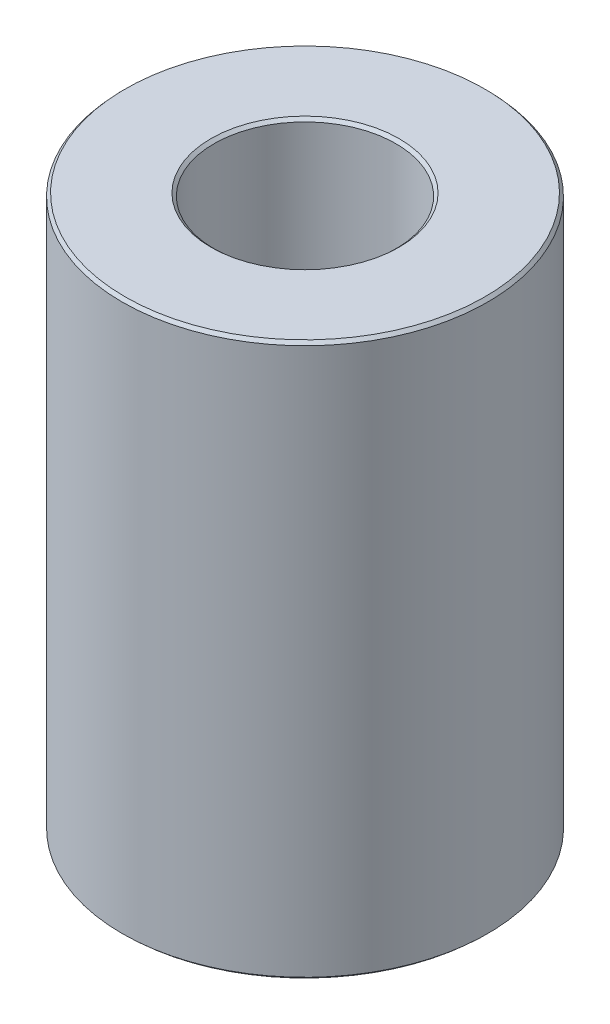
ISO-10303-21;
HEADER;
FILE_DESCRIPTION(('STEP AP214'),'2;1');
FILE_NAME('part.step','',(''),(''),'','','');
FILE_SCHEMA(('AUTOMOTIVE_DESIGN { 1 0 10303 214 1 1 1 1 }'));
ENDSEC;
DATA;
#1=APPLICATION_CONTEXT('core data for automotive mechanical design processes');
#2=APPLICATION_PROTOCOL_DEFINITION('international standard','automotive_design',2000,#1);
#3=PRODUCT_CONTEXT('',#1,'mechanical');
#4=PRODUCT('Part','Part','',(#3));
#5=PRODUCT_RELATED_PRODUCT_CATEGORY('part','',(#4));
#6=PRODUCT_DEFINITION_FORMATION('','',#4);
#7=PRODUCT_DEFINITION_CONTEXT('part definition',#1,'design');
#8=PRODUCT_DEFINITION('design','',#6,#7);
#9=PRODUCT_DEFINITION_SHAPE('','',#8);
#10=(LENGTH_UNIT() NAMED_UNIT(*) SI_UNIT(.MILLI.,.METRE.));
#11=(NAMED_UNIT(*) PLANE_ANGLE_UNIT() SI_UNIT($,.RADIAN.));
#12=(NAMED_UNIT(*) SI_UNIT($,.STERADIAN.) SOLID_ANGLE_UNIT());
#13=UNCERTAINTY_MEASURE_WITH_UNIT(LENGTH_MEASURE(1.E-05),#10,'distance_accuracy_value','');
#14=(GEOMETRIC_REPRESENTATION_CONTEXT(3) GLOBAL_UNCERTAINTY_ASSIGNED_CONTEXT((#13)) GLOBAL_UNIT_ASSIGNED_CONTEXT((#10,
#11,#12)) REPRESENTATION_CONTEXT('',''));
#15=CARTESIAN_POINT('',(0.,0.,0.));
#16=DIRECTION('',(0.,0.,1.));
#17=DIRECTION('',(1.,0.,0.));
#18=AXIS2_PLACEMENT_3D('',#15,#16,#17);
#19=CARTESIAN_POINT('',(0.,151.245814746017,0.));
#20=DIRECTION('',(0.,-1.,0.));
#21=DIRECTION('',(0.,0.,-1.));
#22=AXIS2_PLACEMENT_3D('',#19,#20,#21);
#23=CYLINDRICAL_SURFACE('',#22,50.);
#24=CARTESIAN_POINT('',(0.,0.775924782064841,0.));
#25=DIRECTION('',(0.,1.,0.));
#26=DIRECTION('',(0.,0.,1.));
#27=AXIS2_PLACEMENT_3D('',#24,#25,#26);
#28=CIRCLE('',#27,50.);
#29=CARTESIAN_POINT('',(0.,0.775924782064841,50.));
#30=VERTEX_POINT('',#29);
#31=EDGE_CURVE('E10',#30,#30,#28,.T.);
#32=ORIENTED_EDGE('',*,*,#31,.T.);
#33=EDGE_LOOP('',(#32));
#34=FACE_BOUND('',#33,.T.);
#35=CARTESIAN_POINT('',(0.,150.391701689345,0.));
#36=DIRECTION('',(0.,1.,0.));
#37=DIRECTION('',(0.,0.,1.));
#38=AXIS2_PLACEMENT_3D('',#35,#36,#37);
#39=CIRCLE('',#38,50.);
#40=CARTESIAN_POINT('',(0.,150.391701689345,50.));
#41=VERTEX_POINT('',#40);
#42=EDGE_CURVE('E50',#41,#41,#39,.F.);
#43=ORIENTED_EDGE('',*,*,#42,.T.);
#44=EDGE_LOOP('',(#43));
#45=FACE_BOUND('',#44,.T.);
#46=ADVANCED_FACE('F39',(#34,#45),#23,.T.);
#47=CARTESIAN_POINT('',(0.,151.245814746017,0.));
#48=DIRECTION('',(0.,1.,0.));
#49=DIRECTION('',(0.,0.,1.));
#50=AXIS2_PLACEMENT_3D('',#47,#48,#49);
#51=PLANE('',#50);
#52=CARTESIAN_POINT('',(0.,151.245814746017,0.));
#53=DIRECTION('',(0.,1.,0.));
#54=DIRECTION('',(0.,0.,1.));
#55=AXIS2_PLACEMENT_3D('',#52,#53,#54);
#56=CIRCLE('',#55,25.7456253222907);
#57=CARTESIAN_POINT('',(0.,151.245814746017,25.7456253222907));
#58=VERTEX_POINT('',#57);
#59=EDGE_CURVE('E58',#58,#58,#56,.F.);
#60=ORIENTED_EDGE('',*,*,#59,.T.);
#61=EDGE_LOOP('',(#60));
#62=FACE_BOUND('',#61,.T.);
#63=CARTESIAN_POINT('',(0.,151.245814746017,0.));
#64=DIRECTION('',(0.,1.,0.));
#65=DIRECTION('',(0.,0.,1.));
#66=AXIS2_PLACEMENT_3D('',#63,#64,#65);
#67=CIRCLE('',#66,49.2240752179351);
#68=CARTESIAN_POINT('',(0.,151.245814746017,49.2240752179351));
#69=VERTEX_POINT('',#68);
#70=EDGE_CURVE('E61',#69,#69,#67,.T.);
#71=ORIENTED_EDGE('',*,*,#70,.T.);
#72=EDGE_LOOP('',(#71));
#73=FACE_BOUND('',#72,.T.);
#74=ADVANCED_FACE('F88',(#62,#73),#51,.T.);
#75=CARTESIAN_POINT('',(0.,0.,0.));
#76=DIRECTION('',(0.,1.,0.));
#77=DIRECTION('',(0.,0.,1.));
#78=AXIS2_PLACEMENT_3D('',#75,#76,#77);
#79=PLANE('',#78);
#80=CARTESIAN_POINT('',(0.,0.,0.));
#81=DIRECTION('',(0.,1.,0.));
#82=DIRECTION('',(0.,0.,1.));
#83=AXIS2_PLACEMENT_3D('',#80,#81,#82);
#84=CIRCLE('',#83,25.6674370476838);
#85=CARTESIAN_POINT('',(0.,0.,25.6674370476838));
#86=VERTEX_POINT('',#85);
#87=EDGE_CURVE('E51',#86,#86,#84,.T.);
#88=ORIENTED_EDGE('',*,*,#87,.T.);
#89=EDGE_LOOP('',(#88));
#90=FACE_BOUND('',#89,.T.);
#91=CARTESIAN_POINT('',(0.,0.,0.));
#92=DIRECTION('',(0.,1.,0.));
#93=DIRECTION('',(0.,0.,1.));
#94=AXIS2_PLACEMENT_3D('',#91,#92,#93);
#95=CIRCLE('',#94,49.1458869433283);
#96=CARTESIAN_POINT('',(0.,0.,49.1458869433283));
#97=VERTEX_POINT('',#96);
#98=EDGE_CURVE('E54',#97,#97,#95,.F.);
#99=ORIENTED_EDGE('',*,*,#98,.T.);
#100=EDGE_LOOP('',(#99));
#101=FACE_BOUND('',#100,.T.);
#102=ADVANCED_FACE('F83',(#90,#101),#79,.F.);
#103=CARTESIAN_POINT('',(0.,151.245814746017,0.));
#104=DIRECTION('',(0.,-1.,0.));
#105=DIRECTION('',(0.,0.,-1.));
#106=AXIS2_PLACEMENT_3D('',#103,#104,#105);
#107=CYLINDRICAL_SURFACE('',#106,24.891512265619);
#108=CARTESIAN_POINT('',(0.,150.469889963952,0.));
#109=DIRECTION('',(0.,1.,0.));
#110=DIRECTION('',(0.,0.,1.));
#111=AXIS2_PLACEMENT_3D('',#108,#109,#110);
#112=CIRCLE('',#111,24.891512265619);
#113=CARTESIAN_POINT('',(0.,150.469889963952,24.891512265619));
#114=VERTEX_POINT('',#113);
#115=EDGE_CURVE('E67',#114,#114,#112,.T.);
#116=ORIENTED_EDGE('',*,*,#115,.T.);
#117=EDGE_LOOP('',(#116));
#118=FACE_BOUND('',#117,.T.);
#119=CARTESIAN_POINT('',(0.,0.854113056671657,0.));
#120=DIRECTION('',(0.,1.,0.));
#121=DIRECTION('',(0.,0.,1.));
#122=AXIS2_PLACEMENT_3D('',#119,#120,#121);
#123=CIRCLE('',#122,24.891512265619);
#124=CARTESIAN_POINT('',(0.,0.854113056671657,24.891512265619));
#125=VERTEX_POINT('',#124);
#126=EDGE_CURVE('E69',#125,#125,#123,.F.);
#127=ORIENTED_EDGE('',*,*,#126,.T.);
#128=EDGE_LOOP('',(#127));
#129=FACE_BOUND('',#128,.T.);
#130=ADVANCED_FACE('F71',(#118,#129),#107,.F.);
#131=CARTESIAN_POINT('',(0.,150.469889963952,0.));
#132=DIRECTION('',(0.,1.,0.));
#133=DIRECTION('',(0.,0.,1.));
#134=AXIS2_PLACEMENT_3D('',#131,#132,#133);
#135=CONICAL_SURFACE('',#134,24.891512265619,0.833328578851164);
#136=ORIENTED_EDGE('',*,*,#59,.F.);
#137=EDGE_LOOP('',(#136));
#138=FACE_BOUND('',#137,.T.);
#139=ORIENTED_EDGE('',*,*,#115,.F.);
#140=EDGE_LOOP('',(#139));
#141=FACE_BOUND('',#140,.T.);
#142=ADVANCED_FACE('F77',(#138,#141),#135,.F.);
#143=CARTESIAN_POINT('',(0.,0.,0.));
#144=DIRECTION('',(0.,-1.,0.));
#145=DIRECTION('',(0.,0.,-1.));
#146=AXIS2_PLACEMENT_3D('',#143,#144,#145);
#147=CONICAL_SURFACE('',#146,25.6674370476838,0.737467747943743);
#148=ORIENTED_EDGE('',*,*,#126,.F.);
#149=EDGE_LOOP('',(#148));
#150=FACE_BOUND('',#149,.T.);
#151=ORIENTED_EDGE('',*,*,#87,.F.);
#152=EDGE_LOOP('',(#151));
#153=FACE_BOUND('',#152,.T.);
#154=ADVANCED_FACE('F73',(#150,#153),#147,.F.);
#155=CARTESIAN_POINT('',(0.,0.775924782064841,0.));
#156=DIRECTION('',(0.,1.,0.));
#157=DIRECTION('',(0.,0.,1.));
#158=AXIS2_PLACEMENT_3D('',#155,#156,#157);
#159=CONICAL_SURFACE('',#158,50.,0.833328578851149);
#160=ORIENTED_EDGE('',*,*,#98,.F.);
#161=EDGE_LOOP('',(#160));
#162=FACE_BOUND('',#161,.T.);
#163=ORIENTED_EDGE('',*,*,#31,.F.);
#164=EDGE_LOOP('',(#163));
#165=FACE_BOUND('',#164,.T.);
#166=ADVANCED_FACE('F76',(#162,#165),#159,.T.);
#167=CARTESIAN_POINT('',(0.,151.245814746017,0.));
#168=DIRECTION('',(0.,-1.,0.));
#169=DIRECTION('',(0.,0.,-1.));
#170=AXIS2_PLACEMENT_3D('',#167,#168,#169);
#171=CONICAL_SURFACE('',#170,49.2240752179351,0.737467747943734);
#172=ORIENTED_EDGE('',*,*,#42,.F.);
#173=EDGE_LOOP('',(#172));
#174=FACE_BOUND('',#173,.T.);
#175=ORIENTED_EDGE('',*,*,#70,.F.);
#176=EDGE_LOOP('',(#175));
#177=FACE_BOUND('',#176,.T.);
#178=ADVANCED_FACE('F45',(#174,#177),#171,.T.);
#179=CLOSED_SHELL('',(#46,#74,#102,#130,#142,#154,#166,#178));
#180=MANIFOLD_SOLID_BREP('B2',#179);
#181=ADVANCED_BREP_SHAPE_REPRESENTATION('',(#18,#180),#14);
#182=SHAPE_DEFINITION_REPRESENTATION(#9,#181);
ENDSEC;
END-ISO-10303-21;
